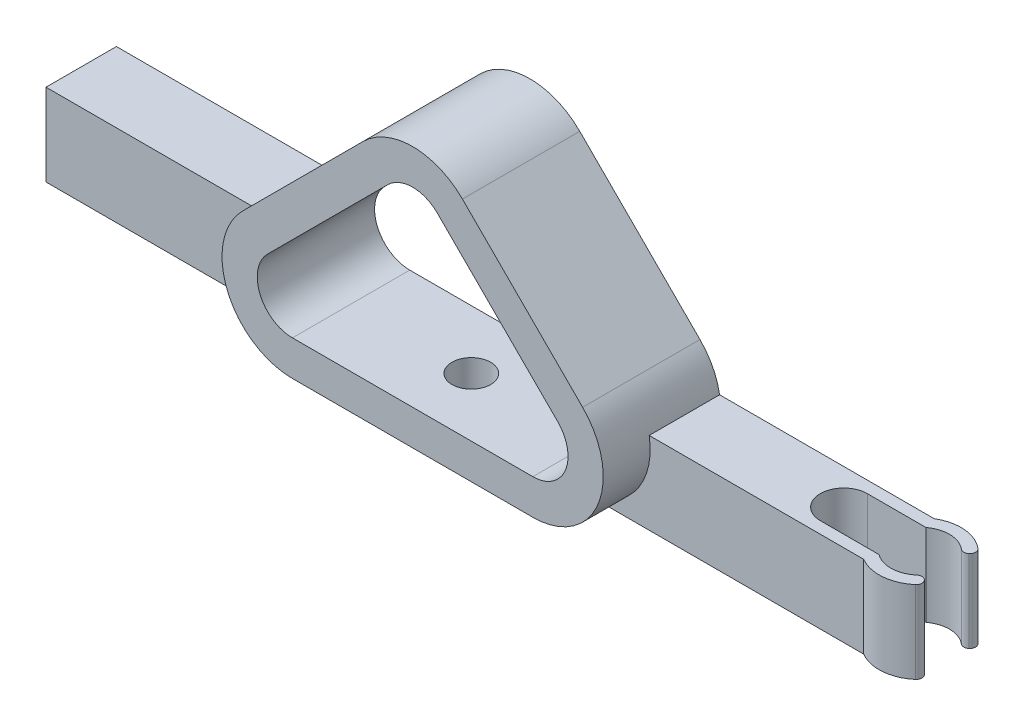
ISO-10303-21;
HEADER;
FILE_DESCRIPTION(('STEP AP214'),'2;1');
FILE_NAME('part.step','',(''),(''),'','','');
FILE_SCHEMA(('AUTOMOTIVE_DESIGN { 1 0 10303 214 1 1 1 1 }'));
ENDSEC;
DATA;
#1=APPLICATION_CONTEXT('core data for automotive mechanical design processes');
#2=APPLICATION_PROTOCOL_DEFINITION('international standard','automotive_design',2000,#1);
#3=PRODUCT_CONTEXT('',#1,'mechanical');
#4=PRODUCT('Part','Part','',(#3));
#5=PRODUCT_RELATED_PRODUCT_CATEGORY('part','',(#4));
#6=PRODUCT_DEFINITION_FORMATION('','',#4);
#7=PRODUCT_DEFINITION_CONTEXT('part definition',#1,'design');
#8=PRODUCT_DEFINITION('design','',#6,#7);
#9=PRODUCT_DEFINITION_SHAPE('','',#8);
#10=(LENGTH_UNIT() NAMED_UNIT(*) SI_UNIT(.MILLI.,.METRE.));
#11=(NAMED_UNIT(*) PLANE_ANGLE_UNIT() SI_UNIT($,.RADIAN.));
#12=(NAMED_UNIT(*) SI_UNIT($,.STERADIAN.) SOLID_ANGLE_UNIT());
#13=UNCERTAINTY_MEASURE_WITH_UNIT(LENGTH_MEASURE(1.E-05),#10,'distance_accuracy_value','');
#14=(GEOMETRIC_REPRESENTATION_CONTEXT(3) GLOBAL_UNCERTAINTY_ASSIGNED_CONTEXT((#13)) GLOBAL_UNIT_ASSIGNED_CONTEXT((#10,
#11,#12)) REPRESENTATION_CONTEXT('',''));
#15=CARTESIAN_POINT('',(0.,0.,0.));
#16=DIRECTION('',(0.,0.,1.));
#17=DIRECTION('',(1.,0.,0.));
#18=AXIS2_PLACEMENT_3D('',#15,#16,#17);
#19=CARTESIAN_POINT('',(36.2426406871193,-5.,3.));
#20=DIRECTION('',(0.,-1.,0.));
#21=DIRECTION('',(0.,0.,-1.));
#22=AXIS2_PLACEMENT_3D('',#19,#20,#21);
#23=CYLINDRICAL_SURFACE('',#22,2.5);
#24=CARTESIAN_POINT('',(36.2426406871193,-12.,3.));
#25=DIRECTION('',(0.,-1.,0.));
#26=DIRECTION('',(0.,0.,-1.));
#27=AXIS2_PLACEMENT_3D('',#24,#25,#26);
#28=CIRCLE('',#27,2.5);
#29=CARTESIAN_POINT('',(37.8631375342883,-12.,4.90367801067184));
#30=VERTEX_POINT('',#29);
#31=CARTESIAN_POINT('',(34.7426406871193,-12.,5.00000000000001));
#32=VERTEX_POINT('',#31);
#33=EDGE_CURVE('E269',#30,#32,#28,.T.);
#34=ORIENTED_EDGE('',*,*,#33,.T.);
#35=DIRECTION('',(0.,-1.,0.));
#36=VECTOR('',#35,1.);
#37=CARTESIAN_POINT('',(34.7426406871193,-5.,5.));
#38=LINE('',#37,#36);
#39=CARTESIAN_POINT('',(34.7426406871193,-5.,5.00000000000001));
#40=VERTEX_POINT('',#39);
#41=EDGE_CURVE('E53',#32,#40,#38,.F.);
#42=ORIENTED_EDGE('',*,*,#41,.T.);
#43=CARTESIAN_POINT('',(36.2426406871193,-5.,3.));
#44=DIRECTION('',(0.,-1.,0.));
#45=DIRECTION('',(0.,0.,-1.));
#46=AXIS2_PLACEMENT_3D('',#43,#44,#45);
#47=CIRCLE('',#46,2.5);
#48=CARTESIAN_POINT('',(37.8631375342883,-5.,4.90367801067184));
#49=VERTEX_POINT('',#48);
#50=EDGE_CURVE('E259',#49,#40,#47,.T.);
#51=ORIENTED_EDGE('',*,*,#50,.F.);
#52=DIRECTION('',(0.,-1.,0.));
#53=VECTOR('',#52,1.);
#54=CARTESIAN_POINT('',(37.8631375342883,-5.,4.90367801067184));
#55=LINE('',#54,#53);
#56=EDGE_CURVE('E423',#49,#30,#55,.T.);
#57=ORIENTED_EDGE('',*,*,#56,.T.);
#58=EDGE_LOOP('',(#34,#42,#51,#57));
#59=FACE_BOUND('',#58,.T.);
#60=ADVANCED_FACE('F45',(#59),#23,.F.);
#61=CARTESIAN_POINT('',(10.2426406871193,-6.,10.));
#62=DIRECTION('',(0.,0.,-1.));
#63=DIRECTION('',(-1.,0.,0.));
#64=AXIS2_PLACEMENT_3D('',#61,#62,#63);
#65=CYLINDRICAL_SURFACE('',#64,6.);
#66=DIRECTION('',(0.,0.,-1.));
#67=VECTOR('',#66,1.);
#68=CARTESIAN_POINT('',(16.1587204702189,-5.00000000000001,6.));
#69=LINE('',#68,#67);
#70=CARTESIAN_POINT('',(16.1587204702189,-5.00000000000001,6.));
#71=VERTEX_POINT('',#70);
#72=CARTESIAN_POINT('',(16.1587204702189,-5.00000000000001,0.));
#73=VERTEX_POINT('',#72);
#74=EDGE_CURVE('E292',#71,#73,#69,.T.);
#75=ORIENTED_EDGE('',*,*,#74,.T.);
#76=CARTESIAN_POINT('',(10.2426406871193,-6.,0.));
#77=DIRECTION('',(0.,0.,1.));
#78=DIRECTION('',(-1.,0.,0.));
#79=AXIS2_PLACEMENT_3D('',#76,#77,#78);
#80=CIRCLE('',#79,6.);
#81=CARTESIAN_POINT('',(14.4852813742386,-1.75735931288071,0.));
#82=VERTEX_POINT('',#81);
#83=EDGE_CURVE('E396',#73,#82,#80,.T.);
#84=ORIENTED_EDGE('',*,*,#83,.T.);
#85=DIRECTION('',(0.,0.,-1.));
#86=VECTOR('',#85,1.);
#87=CARTESIAN_POINT('',(14.4852813742386,-1.75735931288071,10.));
#88=LINE('',#87,#86);
#89=CARTESIAN_POINT('',(14.4852813742386,-1.75735931288071,10.));
#90=VERTEX_POINT('',#89);
#91=EDGE_CURVE('E401',#90,#82,#88,.T.);
#92=ORIENTED_EDGE('',*,*,#91,.F.);
#93=CARTESIAN_POINT('',(10.2426406871193,-6.,10.));
#94=DIRECTION('',(0.,0.,1.));
#95=DIRECTION('',(-1.,0.,0.));
#96=AXIS2_PLACEMENT_3D('',#93,#94,#95);
#97=CIRCLE('',#96,6.);
#98=CARTESIAN_POINT('',(10.2426406871193,-12.,10.));
#99=VERTEX_POINT('',#98);
#100=EDGE_CURVE('E382',#99,#90,#97,.T.);
#101=ORIENTED_EDGE('',*,*,#100,.F.);
#102=DIRECTION('',(0.,0.,-1.));
#103=VECTOR('',#102,1.);
#104=CARTESIAN_POINT('',(10.2426406871193,-12.,10.));
#105=LINE('',#104,#103);
#106=CARTESIAN_POINT('',(10.2426406871193,-12.,6.));
#107=VERTEX_POINT('',#106);
#108=EDGE_CURVE('E404',#99,#107,#105,.T.);
#109=ORIENTED_EDGE('',*,*,#108,.T.);
#110=CARTESIAN_POINT('',(10.2426406871193,-5.99999999999999,6.));
#111=DIRECTION('',(0.,0.,-1.));
#112=DIRECTION('',(1.,0.,0.));
#113=AXIS2_PLACEMENT_3D('',#110,#111,#112);
#114=CIRCLE('',#113,6.00000000000001);
#115=EDGE_CURVE('E284',#71,#107,#114,.T.);
#116=ORIENTED_EDGE('',*,*,#115,.F.);
#117=EDGE_LOOP('',(#75,#84,#92,#101,#109,#116));
#118=FACE_BOUND('',#117,.T.);
#119=ADVANCED_FACE('F477',(#118),#65,.T.);
#120=CARTESIAN_POINT('',(-10.2426406871193,-6.,10.));
#121=DIRECTION('',(0.,0.,-1.));
#122=DIRECTION('',(-1.,0.,0.));
#123=AXIS2_PLACEMENT_3D('',#120,#121,#122);
#124=CYLINDRICAL_SURFACE('',#123,6.);
#125=DIRECTION('',(0.,0.,-1.));
#126=VECTOR('',#125,1.);
#127=CARTESIAN_POINT('',(-16.1587204702189,-5.00000000000001,6.));
#128=LINE('',#127,#126);
#129=CARTESIAN_POINT('',(-16.1587204702189,-5.00000000000001,6.));
#130=VERTEX_POINT('',#129);
#131=CARTESIAN_POINT('',(-16.1587204702189,-5.00000000000001,0.));
#132=VERTEX_POINT('',#131);
#133=EDGE_CURVE('E317',#130,#132,#128,.T.);
#134=ORIENTED_EDGE('',*,*,#133,.F.);
#135=CARTESIAN_POINT('',(-10.2426406871193,-5.99999999999999,6.));
#136=DIRECTION('',(0.,0.,-1.));
#137=DIRECTION('',(-1.,0.,0.));
#138=AXIS2_PLACEMENT_3D('',#135,#136,#137);
#139=CIRCLE('',#138,6.00000000000001);
#140=CARTESIAN_POINT('',(-10.2426406871193,-12.,6.));
#141=VERTEX_POINT('',#140);
#142=EDGE_CURVE('E298',#141,#130,#139,.T.);
#143=ORIENTED_EDGE('',*,*,#142,.F.);
#144=DIRECTION('',(0.,0.,-1.));
#145=VECTOR('',#144,1.);
#146=CARTESIAN_POINT('',(-10.2426406871193,-12.,10.));
#147=LINE('',#146,#145);
#148=CARTESIAN_POINT('',(-10.2426406871193,-12.,10.));
#149=VERTEX_POINT('',#148);
#150=EDGE_CURVE('E406',#149,#141,#147,.T.);
#151=ORIENTED_EDGE('',*,*,#150,.F.);
#152=CARTESIAN_POINT('',(-10.2426406871193,-6.,10.));
#153=DIRECTION('',(0.,0.,1.));
#154=DIRECTION('',(1.,0.,0.));
#155=AXIS2_PLACEMENT_3D('',#152,#153,#154);
#156=CIRCLE('',#155,6.);
#157=CARTESIAN_POINT('',(-14.4852813742386,-1.75735931288072,10.));
#158=VERTEX_POINT('',#157);
#159=EDGE_CURVE('E378',#158,#149,#156,.T.);
#160=ORIENTED_EDGE('',*,*,#159,.F.);
#161=DIRECTION('',(0.,0.,-1.));
#162=VECTOR('',#161,1.);
#163=CARTESIAN_POINT('',(-14.4852813742386,-1.75735931288072,10.));
#164=LINE('',#163,#162);
#165=CARTESIAN_POINT('',(-14.4852813742386,-1.75735931288072,0.));
#166=VERTEX_POINT('',#165);
#167=EDGE_CURVE('E409',#158,#166,#164,.T.);
#168=ORIENTED_EDGE('',*,*,#167,.T.);
#169=CARTESIAN_POINT('',(-10.2426406871193,-6.,0.));
#170=DIRECTION('',(0.,0.,1.));
#171=DIRECTION('',(1.,0.,0.));
#172=AXIS2_PLACEMENT_3D('',#169,#170,#171);
#173=CIRCLE('',#172,6.);
#174=EDGE_CURVE('E391',#166,#132,#173,.T.);
#175=ORIENTED_EDGE('',*,*,#174,.T.);
#176=EDGE_LOOP('',(#134,#143,#151,#160,#168,#175));
#177=FACE_BOUND('',#176,.T.);
#178=ADVANCED_FACE('F489',(#177),#124,.T.);
#179=CARTESIAN_POINT('',(0.,4.24264068711928,10.));
#180=DIRECTION('',(0.,0.,-1.));
#181=DIRECTION('',(-1.,0.,0.));
#182=AXIS2_PLACEMENT_3D('',#179,#180,#181);
#183=PLANE('',#182);
#184=CARTESIAN_POINT('',(0.,4.24264068711928,10.));
#185=DIRECTION('',(0.,0.,1.));
#186=DIRECTION('',(-1.,0.,0.));
#187=AXIS2_PLACEMENT_3D('',#184,#185,#186);
#188=CIRCLE('',#187,6.);
#189=CARTESIAN_POINT('',(4.24264068711927,8.48528137423857,10.));
#190=VERTEX_POINT('',#189);
#191=CARTESIAN_POINT('',(-4.24264068711928,8.48528137423857,10.));
#192=VERTEX_POINT('',#191);
#193=EDGE_CURVE('E372',#190,#192,#188,.T.);
#194=ORIENTED_EDGE('',*,*,#193,.T.);
#195=DIRECTION('',(-0.707106781186549,-0.707106781186546,0.));
#196=VECTOR('',#195,1.);
#197=CARTESIAN_POINT('',(-14.4852813742386,-1.75735931288072,10.));
#198=LINE('',#197,#196);
#199=EDGE_CURVE('E375',#192,#158,#198,.T.);
#200=ORIENTED_EDGE('',*,*,#199,.T.);
#201=ORIENTED_EDGE('',*,*,#159,.T.);
#202=DIRECTION('',(1.,0.,0.));
#203=VECTOR('',#202,1.);
#204=CARTESIAN_POINT('',(10.2426406871193,-12.,10.));
#205=LINE('',#204,#203);
#206=EDGE_CURVE('E380',#149,#99,#205,.T.);
#207=ORIENTED_EDGE('',*,*,#206,.T.);
#208=ORIENTED_EDGE('',*,*,#100,.T.);
#209=DIRECTION('',(-0.707106781186549,0.707106781186546,0.));
#210=VECTOR('',#209,1.);
#211=CARTESIAN_POINT('',(14.4852813742386,-1.75735931288072,10.));
#212=LINE('',#211,#210);
#213=EDGE_CURVE('E384',#90,#190,#212,.T.);
#214=ORIENTED_EDGE('',*,*,#213,.T.);
#215=EDGE_LOOP('',(#194,#200,#201,#207,#208,#214));
#216=FACE_BOUND('',#215,.T.);
#217=CARTESIAN_POINT('',(0.,4.24264068711928,10.));
#218=DIRECTION('',(0.,0.,1.));
#219=DIRECTION('',(-1.,0.,0.));
#220=AXIS2_PLACEMENT_3D('',#217,#218,#219);
#221=CIRCLE('',#220,3.);
#222=CARTESIAN_POINT('',(2.12132034355964,6.36396103067892,10.));
#223=VERTEX_POINT('',#222);
#224=CARTESIAN_POINT('',(-2.12132034355963,6.36396103067892,10.));
#225=VERTEX_POINT('',#224);
#226=EDGE_CURVE('E327',#223,#225,#221,.T.);
#227=ORIENTED_EDGE('',*,*,#226,.F.);
#228=DIRECTION('',(-0.707106781186549,0.707106781186546,0.));
#229=VECTOR('',#228,1.);
#230=CARTESIAN_POINT('',(12.363961030679,-3.87867965644036,10.));
#231=LINE('',#230,#229);
#232=CARTESIAN_POINT('',(12.363961030679,-3.87867965644036,10.));
#233=VERTEX_POINT('',#232);
#234=EDGE_CURVE('E339',#233,#223,#231,.T.);
#235=ORIENTED_EDGE('',*,*,#234,.F.);
#236=CARTESIAN_POINT('',(10.2426406871193,-6.,10.));
#237=DIRECTION('',(0.,0.,1.));
#238=DIRECTION('',(-1.,0.,0.));
#239=AXIS2_PLACEMENT_3D('',#236,#237,#238);
#240=CIRCLE('',#239,3.);
#241=CARTESIAN_POINT('',(10.2426406871193,-9.,10.));
#242=VERTEX_POINT('',#241);
#243=EDGE_CURVE('E336',#242,#233,#240,.T.);
#244=ORIENTED_EDGE('',*,*,#243,.F.);
#245=DIRECTION('',(1.,0.,0.));
#246=VECTOR('',#245,1.);
#247=CARTESIAN_POINT('',(10.2426406871193,-9.,10.));
#248=LINE('',#247,#246);
#249=CARTESIAN_POINT('',(-10.2426406871193,-9.,10.));
#250=VERTEX_POINT('',#249);
#251=EDGE_CURVE('E334',#250,#242,#248,.T.);
#252=ORIENTED_EDGE('',*,*,#251,.F.);
#253=CARTESIAN_POINT('',(-10.2426406871193,-6.,10.));
#254=DIRECTION('',(0.,0.,1.));
#255=DIRECTION('',(-1.,0.,0.));
#256=AXIS2_PLACEMENT_3D('',#253,#254,#255);
#257=CIRCLE('',#256,3.);
#258=CARTESIAN_POINT('',(-12.363961030679,-3.87867965644036,10.));
#259=VERTEX_POINT('',#258);
#260=EDGE_CURVE('E332',#259,#250,#257,.T.);
#261=ORIENTED_EDGE('',*,*,#260,.F.);
#262=DIRECTION('',(-0.707106781186549,-0.707106781186546,0.));
#263=VECTOR('',#262,1.);
#264=CARTESIAN_POINT('',(-12.363961030679,-3.87867965644036,10.));
#265=LINE('',#264,#263);
#266=EDGE_CURVE('E329',#225,#259,#265,.T.);
#267=ORIENTED_EDGE('',*,*,#266,.F.);
#268=EDGE_LOOP('',(#227,#235,#244,#252,#261,#267));
#269=FACE_BOUND('',#268,.T.);
#270=ADVANCED_FACE('F480',(#216,#269),#183,.F.);
#271=CARTESIAN_POINT('',(0.,4.24264068711928,0.));
#272=DIRECTION('',(0.,0.,-1.));
#273=DIRECTION('',(-1.,0.,0.));
#274=AXIS2_PLACEMENT_3D('',#271,#272,#273);
#275=PLANE('',#274);
#276=CARTESIAN_POINT('',(0.,4.24264068711928,0.));
#277=DIRECTION('',(0.,0.,1.));
#278=DIRECTION('',(-1.,0.,0.));
#279=AXIS2_PLACEMENT_3D('',#276,#277,#278);
#280=CIRCLE('',#279,6.);
#281=CARTESIAN_POINT('',(4.24264068711927,8.48528137423857,0.));
#282=VERTEX_POINT('',#281);
#283=CARTESIAN_POINT('',(-4.24264068711928,8.48528137423857,0.));
#284=VERTEX_POINT('',#283);
#285=EDGE_CURVE('E371',#282,#284,#280,.T.);
#286=ORIENTED_EDGE('',*,*,#285,.F.);
#287=DIRECTION('',(-0.707106781186549,0.707106781186546,0.));
#288=VECTOR('',#287,1.);
#289=CARTESIAN_POINT('',(14.4852813742386,-1.75735931288072,0.));
#290=LINE('',#289,#288);
#291=EDGE_CURVE('E376',#82,#282,#290,.T.);
#292=ORIENTED_EDGE('',*,*,#291,.F.);
#293=ORIENTED_EDGE('',*,*,#83,.F.);
#294=DIRECTION('',(-1.,0.,0.));
#295=VECTOR('',#294,1.);
#296=CARTESIAN_POINT('',(30.2426406871193,-5.,0.));
#297=LINE('',#296,#295);
#298=CARTESIAN_POINT('',(34.4398650493873,-5.,0.));
#299=VERTEX_POINT('',#298);
#300=EDGE_CURVE('E281',#299,#73,#297,.T.);
#301=ORIENTED_EDGE('',*,*,#300,.F.);
#302=DIRECTION('',(0.,-1.,0.));
#303=VECTOR('',#302,1.);
#304=CARTESIAN_POINT('',(34.4398650493873,-5.,0.));
#305=LINE('',#304,#303);
#306=CARTESIAN_POINT('',(34.4398650493873,-12.,0.));
#307=VERTEX_POINT('',#306);
#308=EDGE_CURVE('E278',#299,#307,#305,.T.);
#309=ORIENTED_EDGE('',*,*,#308,.T.);
#310=DIRECTION('',(1.,0.,0.));
#311=VECTOR('',#310,1.);
#312=CARTESIAN_POINT('',(10.2426406871193,-12.,0.));
#313=LINE('',#312,#311);
#314=CARTESIAN_POINT('',(-35.2426406871193,-12.,0.));
#315=VERTEX_POINT('',#314);
#316=EDGE_CURVE('E394',#315,#307,#313,.T.);
#317=ORIENTED_EDGE('',*,*,#316,.F.);
#318=DIRECTION('',(0.,-1.,0.));
#319=VECTOR('',#318,1.);
#320=CARTESIAN_POINT('',(-35.2426406871193,-12.,0.));
#321=LINE('',#320,#319);
#322=CARTESIAN_POINT('',(-35.2426406871193,-5.00000000000001,0.));
#323=VERTEX_POINT('',#322);
#324=EDGE_CURVE('E302',#323,#315,#321,.T.);
#325=ORIENTED_EDGE('',*,*,#324,.F.);
#326=DIRECTION('',(-1.,0.,0.));
#327=VECTOR('',#326,1.);
#328=CARTESIAN_POINT('',(-35.2426406871193,-5.00000000000001,0.));
#329=LINE('',#328,#327);
#330=EDGE_CURVE('E297',#132,#323,#329,.T.);
#331=ORIENTED_EDGE('',*,*,#330,.F.);
#332=ORIENTED_EDGE('',*,*,#174,.F.);
#333=DIRECTION('',(-0.707106781186549,-0.707106781186546,0.));
#334=VECTOR('',#333,1.);
#335=CARTESIAN_POINT('',(-14.4852813742386,-1.75735931288072,0.));
#336=LINE('',#335,#334);
#337=EDGE_CURVE('E389',#284,#166,#336,.T.);
#338=ORIENTED_EDGE('',*,*,#337,.F.);
#339=EDGE_LOOP('',(#286,#292,#293,#301,#309,#317,#325,#331,#332,#338));
#340=FACE_BOUND('',#339,.T.);
#341=DIRECTION('',(-0.707106781186549,0.707106781186546,0.));
#342=VECTOR('',#341,1.);
#343=CARTESIAN_POINT('',(12.363961030679,-3.87867965644036,0.));
#344=LINE('',#343,#342);
#345=CARTESIAN_POINT('',(12.363961030679,-3.87867965644036,0.));
#346=VERTEX_POINT('',#345);
#347=CARTESIAN_POINT('',(2.12132034355964,6.36396103067892,0.));
#348=VERTEX_POINT('',#347);
#349=EDGE_CURVE('E330',#346,#348,#344,.T.);
#350=ORIENTED_EDGE('',*,*,#349,.T.);
#351=CARTESIAN_POINT('',(0.,4.24264068711928,0.));
#352=DIRECTION('',(0.,0.,1.));
#353=DIRECTION('',(-1.,0.,0.));
#354=AXIS2_PLACEMENT_3D('',#351,#352,#353);
#355=CIRCLE('',#354,3.);
#356=CARTESIAN_POINT('',(-2.12132034355963,6.36396103067892,0.));
#357=VERTEX_POINT('',#356);
#358=EDGE_CURVE('E326',#348,#357,#355,.T.);
#359=ORIENTED_EDGE('',*,*,#358,.T.);
#360=DIRECTION('',(-0.707106781186549,-0.707106781186546,0.));
#361=VECTOR('',#360,1.);
#362=CARTESIAN_POINT('',(-12.363961030679,-3.87867965644036,0.));
#363=LINE('',#362,#361);
#364=CARTESIAN_POINT('',(-12.363961030679,-3.87867965644036,0.));
#365=VERTEX_POINT('',#364);
#366=EDGE_CURVE('E344',#357,#365,#363,.T.);
#367=ORIENTED_EDGE('',*,*,#366,.T.);
#368=CARTESIAN_POINT('',(-10.2426406871193,-6.,0.));
#369=DIRECTION('',(0.,0.,1.));
#370=DIRECTION('',(-1.,0.,0.));
#371=AXIS2_PLACEMENT_3D('',#368,#369,#370);
#372=CIRCLE('',#371,3.);
#373=CARTESIAN_POINT('',(-10.2426406871193,-9.,0.));
#374=VERTEX_POINT('',#373);
#375=EDGE_CURVE('E347',#365,#374,#372,.T.);
#376=ORIENTED_EDGE('',*,*,#375,.T.);
#377=DIRECTION('',(1.,0.,0.));
#378=VECTOR('',#377,1.);
#379=CARTESIAN_POINT('',(10.2426406871193,-9.,0.));
#380=LINE('',#379,#378);
#381=CARTESIAN_POINT('',(10.2426406871193,-9.,0.));
#382=VERTEX_POINT('',#381);
#383=EDGE_CURVE('E350',#374,#382,#380,.T.);
#384=ORIENTED_EDGE('',*,*,#383,.T.);
#385=CARTESIAN_POINT('',(10.2426406871193,-6.,0.));
#386=DIRECTION('',(0.,0.,1.));
#387=DIRECTION('',(-1.,0.,0.));
#388=AXIS2_PLACEMENT_3D('',#385,#386,#387);
#389=CIRCLE('',#388,3.);
#390=EDGE_CURVE('E353',#382,#346,#389,.T.);
#391=ORIENTED_EDGE('',*,*,#390,.T.);
#392=EDGE_LOOP('',(#350,#359,#367,#376,#384,#391));
#393=FACE_BOUND('',#392,.T.);
#394=ADVANCED_FACE('F501',(#340,#393),#275,.T.);
#395=CARTESIAN_POINT('',(0.,4.24264068711928,10.));
#396=DIRECTION('',(0.,0.,-1.));
#397=DIRECTION('',(-1.,0.,0.));
#398=AXIS2_PLACEMENT_3D('',#395,#396,#397);
#399=CYLINDRICAL_SURFACE('',#398,6.);
#400=ORIENTED_EDGE('',*,*,#285,.T.);
#401=DIRECTION('',(0.,0.,-1.));
#402=VECTOR('',#401,1.);
#403=CARTESIAN_POINT('',(-4.24264068711928,8.48528137423857,10.));
#404=LINE('',#403,#402);
#405=EDGE_CURVE('E412',#192,#284,#404,.T.);
#406=ORIENTED_EDGE('',*,*,#405,.F.);
#407=ORIENTED_EDGE('',*,*,#193,.F.);
#408=DIRECTION('',(0.,0.,-1.));
#409=VECTOR('',#408,1.);
#410=CARTESIAN_POINT('',(4.24264068711927,8.48528137423857,10.));
#411=LINE('',#410,#409);
#412=EDGE_CURVE('E386',#190,#282,#411,.T.);
#413=ORIENTED_EDGE('',*,*,#412,.T.);
#414=EDGE_LOOP('',(#400,#406,#407,#413));
#415=FACE_BOUND('',#414,.T.);
#416=ADVANCED_FACE('F590',(#415),#399,.T.);
#417=CARTESIAN_POINT('',(-14.4852813742386,-1.75735931288072,10.));
#418=DIRECTION('',(0.707106781186546,-0.707106781186549,0.));
#419=DIRECTION('',(0.707106781186549,0.707106781186546,0.));
#420=AXIS2_PLACEMENT_3D('',#417,#418,#419);
#421=PLANE('',#420);
#422=ORIENTED_EDGE('',*,*,#337,.T.);
#423=ORIENTED_EDGE('',*,*,#167,.F.);
#424=ORIENTED_EDGE('',*,*,#199,.F.);
#425=ORIENTED_EDGE('',*,*,#405,.T.);
#426=EDGE_LOOP('',(#422,#423,#424,#425));
#427=FACE_BOUND('',#426,.T.);
#428=ADVANCED_FACE('F596',(#427),#421,.F.);
#429=CARTESIAN_POINT('',(10.2426406871193,-12.,10.));
#430=DIRECTION('',(0.,1.,0.));
#431=DIRECTION('',(0.,0.,1.));
#432=AXIS2_PLACEMENT_3D('',#429,#430,#431);
#433=PLANE('',#432);
#434=CARTESIAN_POINT('',(0.,-12.,5.));
#435=DIRECTION('',(0.,-1.,0.));
#436=DIRECTION('',(0.,0.,-1.));
#437=AXIS2_PLACEMENT_3D('',#434,#435,#436);
#438=CIRCLE('',#437,1.65);
#439=CARTESIAN_POINT('',(0.,-12.,3.35));
#440=VERTEX_POINT('',#439);
#441=EDGE_CURVE('E320',#440,#440,#438,.T.);
#442=ORIENTED_EDGE('',*,*,#441,.F.);
#443=EDGE_LOOP('',(#442));
#444=FACE_BOUND('',#443,.T.);
#445=CARTESIAN_POINT('',(29.7426406871193,-12.,3.));
#446=DIRECTION('',(0.,-1.,0.));
#447=DIRECTION('',(0.,0.,-1.));
#448=AXIS2_PLACEMENT_3D('',#445,#446,#447);
#449=CIRCLE('',#448,2.);
#450=CARTESIAN_POINT('',(29.7426406871193,-12.,5.));
#451=VERTEX_POINT('',#450);
#452=CARTESIAN_POINT('',(29.7426406871193,-12.,1.));
#453=VERTEX_POINT('',#452);
#454=EDGE_CURVE('E239',#451,#453,#449,.T.);
#455=ORIENTED_EDGE('',*,*,#454,.F.);
#456=DIRECTION('',(-1.,0.,0.));
#457=VECTOR('',#456,1.);
#458=CARTESIAN_POINT('',(29.7426406871193,-12.,5.));
#459=LINE('',#458,#457);
#460=EDGE_CURVE('E236',#32,#451,#459,.T.);
#461=ORIENTED_EDGE('',*,*,#460,.F.);
#462=ORIENTED_EDGE('',*,*,#33,.F.);
#463=CARTESIAN_POINT('',(38.1872369037221,-12.,5.28441361280621));
#464=DIRECTION('',(0.,1.,0.));
#465=DIRECTION('',(0.,0.,1.));
#466=AXIS2_PLACEMENT_3D('',#463,#464,#465);
#467=CIRCLE('',#466,0.5);
#468=CARTESIAN_POINT('',(38.5086307085653,-12.,4.90139139124672));
#469=VERTEX_POINT('',#468);
#470=EDGE_CURVE('E415',#30,#469,#467,.F.);
#471=ORIENTED_EDGE('',*,*,#470,.T.);
#472=CARTESIAN_POINT('',(38.1872369037221,-12.,5.28441361280622));
#473=DIRECTION('',(0.,1.,0.));
#474=DIRECTION('',(0.,0.,1.));
#475=AXIS2_PLACEMENT_3D('',#472,#473,#474);
#476=CIRCLE('',#475,0.5);
#477=CARTESIAN_POINT('',(38.5113362731559,-12.,5.66514921494058));
#478=VERTEX_POINT('',#477);
#479=EDGE_CURVE('E417',#469,#478,#476,.F.);
#480=ORIENTED_EDGE('',*,*,#479,.T.);
#481=CARTESIAN_POINT('',(36.2426406871193,-12.,3.));
#482=DIRECTION('',(0.,-1.,0.));
#483=DIRECTION('',(0.,0.,-1.));
#484=AXIS2_PLACEMENT_3D('',#481,#482,#483);
#485=CIRCLE('',#484,3.50000000000001);
#486=CARTESIAN_POINT('',(34.4398650493873,-12.,6.));
#487=VERTEX_POINT('',#486);
#488=EDGE_CURVE('E272',#487,#478,#485,.F.);
#489=ORIENTED_EDGE('',*,*,#488,.F.);
#490=DIRECTION('',(1.,0.,0.));
#491=VECTOR('',#490,1.);
#492=CARTESIAN_POINT('',(10.2426406871193,-12.,6.));
#493=LINE('',#492,#491);
#494=EDGE_CURVE('E287',#107,#487,#493,.T.);
#495=ORIENTED_EDGE('',*,*,#494,.F.);
#496=ORIENTED_EDGE('',*,*,#108,.F.);
#497=ORIENTED_EDGE('',*,*,#206,.F.);
#498=ORIENTED_EDGE('',*,*,#150,.T.);
#499=DIRECTION('',(1.,0.,0.));
#500=VECTOR('',#499,1.);
#501=CARTESIAN_POINT('',(-10.2426406871193,-12.,6.));
#502=LINE('',#501,#500);
#503=CARTESIAN_POINT('',(-35.2426406871193,-12.,6.));
#504=VERTEX_POINT('',#503);
#505=EDGE_CURVE('E306',#504,#141,#502,.T.);
#506=ORIENTED_EDGE('',*,*,#505,.F.);
#507=DIRECTION('',(0.,0.,-1.));
#508=VECTOR('',#507,1.);
#509=CARTESIAN_POINT('',(-35.2426406871193,-12.,6.));
#510=LINE('',#509,#508);
#511=EDGE_CURVE('E308',#504,#315,#510,.T.);
#512=ORIENTED_EDGE('',*,*,#511,.T.);
#513=ORIENTED_EDGE('',*,*,#316,.T.);
#514=CARTESIAN_POINT('',(36.2426406871193,-12.,3.));
#515=DIRECTION('',(0.,-1.,0.));
#516=DIRECTION('',(0.,0.,-1.));
#517=AXIS2_PLACEMENT_3D('',#514,#515,#516);
#518=CIRCLE('',#517,3.50000000000001);
#519=CARTESIAN_POINT('',(38.5113362731559,-12.,0.334850785059418));
#520=VERTEX_POINT('',#519);
#521=EDGE_CURVE('E275',#307,#520,#518,.T.);
#522=ORIENTED_EDGE('',*,*,#521,.T.);
#523=CARTESIAN_POINT('',(38.1872369037221,-12.,0.715586387193788));
#524=DIRECTION('',(0.,1.,0.));
#525=DIRECTION('',(0.,0.,1.));
#526=AXIS2_PLACEMENT_3D('',#523,#524,#525);
#527=CIRCLE('',#526,0.5);
#528=CARTESIAN_POINT('',(38.5086307085653,-12.,1.09860860875327));
#529=VERTEX_POINT('',#528);
#530=EDGE_CURVE('E419',#520,#529,#527,.F.);
#531=ORIENTED_EDGE('',*,*,#530,.T.);
#532=CARTESIAN_POINT('',(38.1872369037221,-12.,0.715586387193793));
#533=DIRECTION('',(0.,1.,0.));
#534=DIRECTION('',(0.,0.,1.));
#535=AXIS2_PLACEMENT_3D('',#532,#533,#534);
#536=CIRCLE('',#535,0.5);
#537=CARTESIAN_POINT('',(37.8631375342883,-12.,1.09632198932816));
#538=VERTEX_POINT('',#537);
#539=EDGE_CURVE('E421',#529,#538,#536,.F.);
#540=ORIENTED_EDGE('',*,*,#539,.T.);
#541=CARTESIAN_POINT('',(34.7426406871193,-12.,1.));
#542=VERTEX_POINT('',#541);
#543=EDGE_CURVE('E249',#542,#538,#28,.T.);
#544=ORIENTED_EDGE('',*,*,#543,.F.);
#545=DIRECTION('',(1.,0.,0.));
#546=VECTOR('',#545,1.);
#547=CARTESIAN_POINT('',(29.7426406871193,-12.,1.));
#548=LINE('',#547,#546);
#549=EDGE_CURVE('E60',#453,#542,#548,.T.);
#550=ORIENTED_EDGE('',*,*,#549,.F.);
#551=EDGE_LOOP('',(#455,#461,#462,#471,#480,#489,#495,#496,#497,#498,#506,#512,#513,#522,#531,
#540,#544,#550));
#552=FACE_BOUND('',#551,.T.);
#553=ADVANCED_FACE('F247',(#444,#552),#433,.F.);
#554=CARTESIAN_POINT('',(14.4852813742386,-1.75735931288072,10.));
#555=DIRECTION('',(-0.707106781186546,-0.707106781186549,0.));
#556=DIRECTION('',(0.707106781186549,-0.707106781186546,0.));
#557=AXIS2_PLACEMENT_3D('',#554,#555,#556);
#558=PLANE('',#557);
#559=ORIENTED_EDGE('',*,*,#291,.T.);
#560=ORIENTED_EDGE('',*,*,#412,.F.);
#561=ORIENTED_EDGE('',*,*,#213,.F.);
#562=ORIENTED_EDGE('',*,*,#91,.T.);
#563=EDGE_LOOP('',(#559,#560,#561,#562));
#564=FACE_BOUND('',#563,.T.);
#565=ADVANCED_FACE('F584',(#564),#558,.F.);
#566=CARTESIAN_POINT('',(0.,4.24264068711928,10.));
#567=DIRECTION('',(0.,0.,-1.));
#568=DIRECTION('',(-1.,0.,0.));
#569=AXIS2_PLACEMENT_3D('',#566,#567,#568);
#570=CYLINDRICAL_SURFACE('',#569,3.);
#571=ORIENTED_EDGE('',*,*,#358,.F.);
#572=DIRECTION('',(0.,0.,-1.));
#573=VECTOR('',#572,1.);
#574=CARTESIAN_POINT('',(2.12132034355964,6.36396103067892,10.));
#575=LINE('',#574,#573);
#576=EDGE_CURVE('E341',#223,#348,#575,.T.);
#577=ORIENTED_EDGE('',*,*,#576,.F.);
#578=ORIENTED_EDGE('',*,*,#226,.T.);
#579=DIRECTION('',(0.,0.,-1.));
#580=VECTOR('',#579,1.);
#581=CARTESIAN_POINT('',(-2.12132034355963,6.36396103067892,10.));
#582=LINE('',#581,#580);
#583=EDGE_CURVE('E368',#225,#357,#582,.T.);
#584=ORIENTED_EDGE('',*,*,#583,.T.);
#585=EDGE_LOOP('',(#571,#577,#578,#584));
#586=FACE_BOUND('',#585,.T.);
#587=ADVANCED_FACE('F580',(#586),#570,.F.);
#588=CARTESIAN_POINT('',(-12.363961030679,-3.87867965644036,10.));
#589=DIRECTION('',(0.707106781186546,-0.707106781186549,0.));
#590=DIRECTION('',(0.707106781186549,0.707106781186546,0.));
#591=AXIS2_PLACEMENT_3D('',#588,#589,#590);
#592=PLANE('',#591);
#593=ORIENTED_EDGE('',*,*,#366,.F.);
#594=ORIENTED_EDGE('',*,*,#583,.F.);
#595=ORIENTED_EDGE('',*,*,#266,.T.);
#596=DIRECTION('',(0.,0.,-1.));
#597=VECTOR('',#596,1.);
#598=CARTESIAN_POINT('',(-12.363961030679,-3.87867965644036,10.));
#599=LINE('',#598,#597);
#600=EDGE_CURVE('E366',#259,#365,#599,.T.);
#601=ORIENTED_EDGE('',*,*,#600,.T.);
#602=EDGE_LOOP('',(#593,#594,#595,#601));
#603=FACE_BOUND('',#602,.T.);
#604=ADVANCED_FACE('F576',(#603),#592,.T.);
#605=CARTESIAN_POINT('',(-10.2426406871193,-6.,10.));
#606=DIRECTION('',(0.,0.,-1.));
#607=DIRECTION('',(-1.,0.,0.));
#608=AXIS2_PLACEMENT_3D('',#605,#606,#607);
#609=CYLINDRICAL_SURFACE('',#608,3.);
#610=ORIENTED_EDGE('',*,*,#375,.F.);
#611=ORIENTED_EDGE('',*,*,#600,.F.);
#612=ORIENTED_EDGE('',*,*,#260,.T.);
#613=DIRECTION('',(0.,0.,-1.));
#614=VECTOR('',#613,1.);
#615=CARTESIAN_POINT('',(-10.2426406871193,-9.,10.));
#616=LINE('',#615,#614);
#617=EDGE_CURVE('E364',#250,#374,#616,.T.);
#618=ORIENTED_EDGE('',*,*,#617,.T.);
#619=EDGE_LOOP('',(#610,#611,#612,#618));
#620=FACE_BOUND('',#619,.T.);
#621=ADVANCED_FACE('F572',(#620),#609,.F.);
#622=CARTESIAN_POINT('',(10.2426406871193,-9.,10.));
#623=DIRECTION('',(0.,1.,0.));
#624=DIRECTION('',(0.,0.,1.));
#625=AXIS2_PLACEMENT_3D('',#622,#623,#624);
#626=PLANE('',#625);
#627=CARTESIAN_POINT('',(0.,-9.,5.));
#628=DIRECTION('',(0.,1.,0.));
#629=DIRECTION('',(0.,0.,1.));
#630=AXIS2_PLACEMENT_3D('',#627,#628,#629);
#631=CIRCLE('',#630,1.65);
#632=CARTESIAN_POINT('',(0.,-9.,6.65));
#633=VERTEX_POINT('',#632);
#634=EDGE_CURVE('E323',#633,#633,#631,.T.);
#635=ORIENTED_EDGE('',*,*,#634,.F.);
#636=EDGE_LOOP('',(#635));
#637=FACE_BOUND('',#636,.T.);
#638=ORIENTED_EDGE('',*,*,#383,.F.);
#639=ORIENTED_EDGE('',*,*,#617,.F.);
#640=ORIENTED_EDGE('',*,*,#251,.T.);
#641=DIRECTION('',(0.,0.,-1.));
#642=VECTOR('',#641,1.);
#643=CARTESIAN_POINT('',(10.2426406871193,-9.,10.));
#644=LINE('',#643,#642);
#645=EDGE_CURVE('E362',#242,#382,#644,.T.);
#646=ORIENTED_EDGE('',*,*,#645,.T.);
#647=EDGE_LOOP('',(#638,#639,#640,#646));
#648=FACE_BOUND('',#647,.T.);
#649=ADVANCED_FACE('F568',(#637,#648),#626,.T.);
#650=CARTESIAN_POINT('',(10.2426406871193,-6.,10.));
#651=DIRECTION('',(0.,0.,-1.));
#652=DIRECTION('',(-1.,0.,0.));
#653=AXIS2_PLACEMENT_3D('',#650,#651,#652);
#654=CYLINDRICAL_SURFACE('',#653,3.);
#655=ORIENTED_EDGE('',*,*,#390,.F.);
#656=ORIENTED_EDGE('',*,*,#645,.F.);
#657=ORIENTED_EDGE('',*,*,#243,.T.);
#658=DIRECTION('',(0.,0.,-1.));
#659=VECTOR('',#658,1.);
#660=CARTESIAN_POINT('',(12.363961030679,-3.87867965644036,10.));
#661=LINE('',#660,#659);
#662=EDGE_CURVE('E360',#233,#346,#661,.T.);
#663=ORIENTED_EDGE('',*,*,#662,.T.);
#664=EDGE_LOOP('',(#655,#656,#657,#663));
#665=FACE_BOUND('',#664,.T.);
#666=ADVANCED_FACE('F564',(#665),#654,.F.);
#667=CARTESIAN_POINT('',(12.363961030679,-3.87867965644036,10.));
#668=DIRECTION('',(-0.707106781186546,-0.707106781186549,0.));
#669=DIRECTION('',(0.707106781186549,-0.707106781186546,0.));
#670=AXIS2_PLACEMENT_3D('',#667,#668,#669);
#671=PLANE('',#670);
#672=ORIENTED_EDGE('',*,*,#349,.F.);
#673=ORIENTED_EDGE('',*,*,#662,.F.);
#674=ORIENTED_EDGE('',*,*,#234,.T.);
#675=ORIENTED_EDGE('',*,*,#576,.T.);
#676=EDGE_LOOP('',(#672,#673,#674,#675));
#677=FACE_BOUND('',#676,.T.);
#678=ADVANCED_FACE('F560',(#677),#671,.T.);
#679=CARTESIAN_POINT('',(0.,-12.,5.));
#680=DIRECTION('',(0.,-1.,0.));
#681=DIRECTION('',(0.,0.,-1.));
#682=AXIS2_PLACEMENT_3D('',#679,#680,#681);
#683=CYLINDRICAL_SURFACE('',#682,1.65);
#684=ORIENTED_EDGE('',*,*,#441,.T.);
#685=EDGE_LOOP('',(#684));
#686=FACE_BOUND('',#685,.T.);
#687=ORIENTED_EDGE('',*,*,#634,.T.);
#688=EDGE_LOOP('',(#687));
#689=FACE_BOUND('',#688,.T.);
#690=ADVANCED_FACE('F556',(#686,#689),#683,.F.);
#691=CARTESIAN_POINT('',(-35.2426406871193,-5.00000000000001,6.));
#692=DIRECTION('',(0.,-1.,0.));
#693=DIRECTION('',(0.,0.,-1.));
#694=AXIS2_PLACEMENT_3D('',#691,#692,#693);
#695=PLANE('',#694);
#696=ORIENTED_EDGE('',*,*,#330,.T.);
#697=DIRECTION('',(0.,0.,-1.));
#698=VECTOR('',#697,1.);
#699=CARTESIAN_POINT('',(-35.2426406871193,-5.00000000000001,6.));
#700=LINE('',#699,#698);
#701=CARTESIAN_POINT('',(-35.2426406871193,-5.00000000000001,6.));
#702=VERTEX_POINT('',#701);
#703=EDGE_CURVE('E314',#702,#323,#700,.T.);
#704=ORIENTED_EDGE('',*,*,#703,.F.);
#705=DIRECTION('',(-1.,0.,0.));
#706=VECTOR('',#705,1.);
#707=CARTESIAN_POINT('',(-35.2426406871193,-5.00000000000001,6.));
#708=LINE('',#707,#706);
#709=EDGE_CURVE('E301',#130,#702,#708,.T.);
#710=ORIENTED_EDGE('',*,*,#709,.F.);
#711=ORIENTED_EDGE('',*,*,#133,.T.);
#712=EDGE_LOOP('',(#696,#704,#710,#711));
#713=FACE_BOUND('',#712,.T.);
#714=ADVANCED_FACE('F553',(#713),#695,.F.);
#715=CARTESIAN_POINT('',(-35.2426406871193,-12.,6.));
#716=DIRECTION('',(1.,0.,0.));
#717=DIRECTION('',(0.,0.,-1.));
#718=AXIS2_PLACEMENT_3D('',#715,#716,#717);
#719=PLANE('',#718);
#720=ORIENTED_EDGE('',*,*,#324,.T.);
#721=ORIENTED_EDGE('',*,*,#511,.F.);
#722=DIRECTION('',(0.,-1.,0.));
#723=VECTOR('',#722,1.);
#724=CARTESIAN_POINT('',(-35.2426406871193,-12.,6.));
#725=LINE('',#724,#723);
#726=EDGE_CURVE('E304',#702,#504,#725,.T.);
#727=ORIENTED_EDGE('',*,*,#726,.F.);
#728=ORIENTED_EDGE('',*,*,#703,.T.);
#729=EDGE_LOOP('',(#720,#721,#727,#728));
#730=FACE_BOUND('',#729,.T.);
#731=ADVANCED_FACE('F497',(#730),#719,.F.);
#732=CARTESIAN_POINT('',(-10.2426406871193,-5.99999999999999,6.));
#733=DIRECTION('',(0.,0.,-1.));
#734=DIRECTION('',(-1.,0.,0.));
#735=AXIS2_PLACEMENT_3D('',#732,#733,#734);
#736=PLANE('',#735);
#737=ORIENTED_EDGE('',*,*,#142,.T.);
#738=ORIENTED_EDGE('',*,*,#709,.T.);
#739=ORIENTED_EDGE('',*,*,#726,.T.);
#740=ORIENTED_EDGE('',*,*,#505,.T.);
#741=EDGE_LOOP('',(#737,#738,#739,#740));
#742=FACE_BOUND('',#741,.T.);
#743=ADVANCED_FACE('F493',(#742),#736,.F.);
#744=CARTESIAN_POINT('',(30.2426406871193,-5.,6.));
#745=DIRECTION('',(0.,-1.,0.));
#746=DIRECTION('',(1.,0.,0.));
#747=AXIS2_PLACEMENT_3D('',#744,#745,#746);
#748=PLANE('',#747);
#749=ORIENTED_EDGE('',*,*,#50,.T.);
#750=DIRECTION('',(-1.,0.,0.));
#751=VECTOR('',#750,1.);
#752=CARTESIAN_POINT('',(30.2426406871193,-5.,5.));
#753=LINE('',#752,#751);
#754=CARTESIAN_POINT('',(29.7426406871193,-5.,5.));
#755=VERTEX_POINT('',#754);
#756=EDGE_CURVE('E255',#40,#755,#753,.T.);
#757=ORIENTED_EDGE('',*,*,#756,.T.);
#758=CARTESIAN_POINT('',(29.7426406871193,-5.,3.));
#759=DIRECTION('',(0.,-1.,0.));
#760=DIRECTION('',(1.,0.,0.));
#761=AXIS2_PLACEMENT_3D('',#758,#759,#760);
#762=CIRCLE('',#761,2.);
#763=CARTESIAN_POINT('',(29.7426406871193,-5.,1.));
#764=VERTEX_POINT('',#763);
#765=EDGE_CURVE('E11',#755,#764,#762,.T.);
#766=ORIENTED_EDGE('',*,*,#765,.T.);
#767=DIRECTION('',(1.,0.,0.));
#768=VECTOR('',#767,1.);
#769=CARTESIAN_POINT('',(30.2426406871193,-5.,1.));
#770=LINE('',#769,#768);
#771=CARTESIAN_POINT('',(34.7426406871193,-5.,1.));
#772=VERTEX_POINT('',#771);
#773=EDGE_CURVE('E233',#764,#772,#770,.T.);
#774=ORIENTED_EDGE('',*,*,#773,.T.);
#775=CARTESIAN_POINT('',(37.8631375342883,-5.,1.09632198932816));
#776=VERTEX_POINT('',#775);
#777=EDGE_CURVE('E263',#772,#776,#47,.T.);
#778=ORIENTED_EDGE('',*,*,#777,.T.);
#779=CARTESIAN_POINT('',(38.1872369037221,-5.,0.715586387193793));
#780=DIRECTION('',(0.,-1.,0.));
#781=DIRECTION('',(1.,0.,0.));
#782=AXIS2_PLACEMENT_3D('',#779,#780,#781);
#783=CIRCLE('',#782,0.5);
#784=CARTESIAN_POINT('',(38.5086307085653,-5.,1.09860860875327));
#785=VERTEX_POINT('',#784);
#786=EDGE_CURVE('E434',#776,#785,#783,.F.);
#787=ORIENTED_EDGE('',*,*,#786,.T.);
#788=CARTESIAN_POINT('',(38.1872369037221,-5.,0.715586387193788));
#789=DIRECTION('',(0.,-1.,0.));
#790=DIRECTION('',(1.,0.,0.));
#791=AXIS2_PLACEMENT_3D('',#788,#789,#790);
#792=CIRCLE('',#791,0.5);
#793=CARTESIAN_POINT('',(38.5113362731559,-5.,0.334850785059418));
#794=VERTEX_POINT('',#793);
#795=EDGE_CURVE('E68',#785,#794,#792,.F.);
#796=ORIENTED_EDGE('',*,*,#795,.T.);
#797=CARTESIAN_POINT('',(36.2426406871193,-5.,3.));
#798=DIRECTION('',(0.,-1.,0.));
#799=DIRECTION('',(0.,0.,-1.));
#800=AXIS2_PLACEMENT_3D('',#797,#798,#799);
#801=CIRCLE('',#800,3.50000000000001);
#802=EDGE_CURVE('E266',#299,#794,#801,.T.);
#803=ORIENTED_EDGE('',*,*,#802,.F.);
#804=ORIENTED_EDGE('',*,*,#300,.T.);
#805=ORIENTED_EDGE('',*,*,#74,.F.);
#806=DIRECTION('',(-1.,0.,0.));
#807=VECTOR('',#806,1.);
#808=CARTESIAN_POINT('',(30.2426406871193,-5.,6.));
#809=LINE('',#808,#807);
#810=CARTESIAN_POINT('',(34.4398650493873,-5.,6.));
#811=VERTEX_POINT('',#810);
#812=EDGE_CURVE('E289',#811,#71,#809,.T.);
#813=ORIENTED_EDGE('',*,*,#812,.F.);
#814=CARTESIAN_POINT('',(36.2426406871193,-5.,3.));
#815=DIRECTION('',(0.,-1.,0.));
#816=DIRECTION('',(0.,0.,-1.));
#817=AXIS2_PLACEMENT_3D('',#814,#815,#816);
#818=CIRCLE('',#817,3.50000000000001);
#819=CARTESIAN_POINT('',(38.5113362731559,-5.,5.66514921494058));
#820=VERTEX_POINT('',#819);
#821=EDGE_CURVE('E262',#811,#820,#818,.F.);
#822=ORIENTED_EDGE('',*,*,#821,.T.);
#823=CARTESIAN_POINT('',(38.1872369037221,-5.,5.28441361280622));
#824=DIRECTION('',(0.,-1.,0.));
#825=DIRECTION('',(1.,0.,0.));
#826=AXIS2_PLACEMENT_3D('',#823,#824,#825);
#827=CIRCLE('',#826,0.5);
#828=CARTESIAN_POINT('',(38.5086307085653,-5.,4.90139139124672));
#829=VERTEX_POINT('',#828);
#830=EDGE_CURVE('E431',#820,#829,#827,.F.);
#831=ORIENTED_EDGE('',*,*,#830,.T.);
#832=CARTESIAN_POINT('',(38.1872369037221,-5.,5.28441361280621));
#833=DIRECTION('',(0.,-1.,0.));
#834=DIRECTION('',(1.,0.,0.));
#835=AXIS2_PLACEMENT_3D('',#832,#833,#834);
#836=CIRCLE('',#835,0.5);
#837=EDGE_CURVE('E429',#829,#49,#836,.F.);
#838=ORIENTED_EDGE('',*,*,#837,.T.);
#839=EDGE_LOOP('',(#749,#757,#766,#774,#778,#787,#796,#803,#804,#805,#813,#822,#831,#838));
#840=FACE_BOUND('',#839,.T.);
#841=ADVANCED_FACE('F454',(#840),#748,.F.);
#842=CARTESIAN_POINT('',(10.2426406871193,-5.99999999999999,6.));
#843=DIRECTION('',(0.,0.,1.));
#844=DIRECTION('',(1.,0.,0.));
#845=AXIS2_PLACEMENT_3D('',#842,#843,#844);
#846=PLANE('',#845);
#847=ORIENTED_EDGE('',*,*,#115,.T.);
#848=ORIENTED_EDGE('',*,*,#494,.T.);
#849=DIRECTION('',(0.,-1.,0.));
#850=VECTOR('',#849,1.);
#851=CARTESIAN_POINT('',(34.4398650493873,-5.,6.));
#852=LINE('',#851,#850);
#853=EDGE_CURVE('E268',#811,#487,#852,.T.);
#854=ORIENTED_EDGE('',*,*,#853,.F.);
#855=ORIENTED_EDGE('',*,*,#812,.T.);
#856=EDGE_LOOP('',(#847,#848,#854,#855));
#857=FACE_BOUND('',#856,.T.);
#858=ADVANCED_FACE('F470',(#857),#846,.T.);
#859=ORIENTED_EDGE('',*,*,#777,.F.);
#860=DIRECTION('',(0.,-1.,0.));
#861=VECTOR('',#860,1.);
#862=CARTESIAN_POINT('',(34.7426406871193,-5.,1.));
#863=LINE('',#862,#861);
#864=EDGE_CURVE('E441',#772,#542,#863,.T.);
#865=ORIENTED_EDGE('',*,*,#864,.T.);
#866=ORIENTED_EDGE('',*,*,#543,.T.);
#867=DIRECTION('',(0.,-1.,0.));
#868=VECTOR('',#867,1.);
#869=CARTESIAN_POINT('',(37.8631375342883,-5.,1.09632198932816));
#870=LINE('',#869,#868);
#871=EDGE_CURVE('E425',#538,#776,#870,.F.);
#872=ORIENTED_EDGE('',*,*,#871,.T.);
#873=EDGE_LOOP('',(#859,#865,#866,#872));
#874=FACE_BOUND('',#873,.T.);
#875=ADVANCED_FACE('F519',(#874),#23,.F.);
#876=CARTESIAN_POINT('',(36.2426406871193,-5.,3.));
#877=DIRECTION('',(0.,-1.,0.));
#878=DIRECTION('',(0.,0.,-1.));
#879=AXIS2_PLACEMENT_3D('',#876,#877,#878);
#880=CYLINDRICAL_SURFACE('',#879,3.50000000000001);
#881=ORIENTED_EDGE('',*,*,#802,.T.);
#882=DIRECTION('',(0.,-1.,0.));
#883=VECTOR('',#882,1.);
#884=CARTESIAN_POINT('',(38.5113362731559,-5.,0.334850785059418));
#885=LINE('',#884,#883);
#886=EDGE_CURVE('E436',#794,#520,#885,.T.);
#887=ORIENTED_EDGE('',*,*,#886,.T.);
#888=ORIENTED_EDGE('',*,*,#521,.F.);
#889=ORIENTED_EDGE('',*,*,#308,.F.);
#890=EDGE_LOOP('',(#881,#887,#888,#889));
#891=FACE_BOUND('',#890,.T.);
#892=ADVANCED_FACE('F538',(#891),#880,.T.);
#893=CARTESIAN_POINT('',(36.2426406871193,-5.,3.));
#894=DIRECTION('',(0.,-1.,0.));
#895=DIRECTION('',(0.,0.,-1.));
#896=AXIS2_PLACEMENT_3D('',#893,#894,#895);
#897=CYLINDRICAL_SURFACE('',#896,3.50000000000001);
#898=ORIENTED_EDGE('',*,*,#488,.T.);
#899=DIRECTION('',(0.,-1.,0.));
#900=VECTOR('',#899,1.);
#901=CARTESIAN_POINT('',(38.5113362731559,-5.,5.66514921494058));
#902=LINE('',#901,#900);
#903=EDGE_CURVE('E438',#478,#820,#902,.F.);
#904=ORIENTED_EDGE('',*,*,#903,.T.);
#905=ORIENTED_EDGE('',*,*,#821,.F.);
#906=ORIENTED_EDGE('',*,*,#853,.T.);
#907=EDGE_LOOP('',(#898,#904,#905,#906));
#908=FACE_BOUND('',#907,.T.);
#909=ADVANCED_FACE('F466',(#908),#897,.T.);
#910=CARTESIAN_POINT('',(38.1872369037221,-5.,0.715586387193788));
#911=DIRECTION('',(0.,-1.,0.));
#912=DIRECTION('',(0.,0.,-1.));
#913=AXIS2_PLACEMENT_3D('',#910,#911,#912);
#914=CYLINDRICAL_SURFACE('',#913,0.5);
#915=ORIENTED_EDGE('',*,*,#886,.F.);
#916=ORIENTED_EDGE('',*,*,#795,.F.);
#917=DIRECTION('',(0.,-1.,0.));
#918=VECTOR('',#917,1.);
#919=CARTESIAN_POINT('',(38.5086307085653,-5.,1.09860860875327));
#920=LINE('',#919,#918);
#921=EDGE_CURVE('E442',#529,#785,#920,.F.);
#922=ORIENTED_EDGE('',*,*,#921,.F.);
#923=ORIENTED_EDGE('',*,*,#530,.F.);
#924=EDGE_LOOP('',(#915,#916,#922,#923));
#925=FACE_BOUND('',#924,.T.);
#926=ADVANCED_FACE('F511',(#925),#914,.T.);
#927=CARTESIAN_POINT('',(38.1872369037221,-5.,0.715586387193793));
#928=DIRECTION('',(0.,-1.,0.));
#929=DIRECTION('',(0.,0.,-1.));
#930=AXIS2_PLACEMENT_3D('',#927,#928,#929);
#931=CYLINDRICAL_SURFACE('',#930,0.5);
#932=ORIENTED_EDGE('',*,*,#786,.F.);
#933=ORIENTED_EDGE('',*,*,#871,.F.);
#934=ORIENTED_EDGE('',*,*,#539,.F.);
#935=ORIENTED_EDGE('',*,*,#921,.T.);
#936=EDGE_LOOP('',(#932,#933,#934,#935));
#937=FACE_BOUND('',#936,.T.);
#938=ADVANCED_FACE('F516',(#937),#931,.T.);
#939=CARTESIAN_POINT('',(38.1872369037221,-5.,5.28441361280621));
#940=DIRECTION('',(0.,-1.,0.));
#941=DIRECTION('',(0.,0.,-1.));
#942=AXIS2_PLACEMENT_3D('',#939,#940,#941);
#943=CYLINDRICAL_SURFACE('',#942,0.5);
#944=ORIENTED_EDGE('',*,*,#56,.F.);
#945=ORIENTED_EDGE('',*,*,#837,.F.);
#946=DIRECTION('',(0.,-1.,0.));
#947=VECTOR('',#946,1.);
#948=CARTESIAN_POINT('',(38.5086307085653,-5.,4.90139139124672));
#949=LINE('',#948,#947);
#950=EDGE_CURVE('E258',#469,#829,#949,.F.);
#951=ORIENTED_EDGE('',*,*,#950,.F.);
#952=ORIENTED_EDGE('',*,*,#470,.F.);
#953=EDGE_LOOP('',(#944,#945,#951,#952));
#954=FACE_BOUND('',#953,.T.);
#955=ADVANCED_FACE('F47',(#954),#943,.T.);
#956=CARTESIAN_POINT('',(38.1872369037221,-5.,5.28441361280622));
#957=DIRECTION('',(0.,-1.,0.));
#958=DIRECTION('',(0.,0.,-1.));
#959=AXIS2_PLACEMENT_3D('',#956,#957,#958);
#960=CYLINDRICAL_SURFACE('',#959,0.5);
#961=ORIENTED_EDGE('',*,*,#830,.F.);
#962=ORIENTED_EDGE('',*,*,#903,.F.);
#963=ORIENTED_EDGE('',*,*,#479,.F.);
#964=ORIENTED_EDGE('',*,*,#950,.T.);
#965=EDGE_LOOP('',(#961,#962,#963,#964));
#966=FACE_BOUND('',#965,.T.);
#967=ADVANCED_FACE('F461',(#966),#960,.T.);
#968=CARTESIAN_POINT('',(29.7426406871193,10.2426406871193,3.));
#969=DIRECTION('',(0.,-1.,0.));
#970=DIRECTION('',(0.,0.,-1.));
#971=AXIS2_PLACEMENT_3D('',#968,#969,#970);
#972=CYLINDRICAL_SURFACE('',#971,2.);
#973=DIRECTION('',(0.,-1.,0.));
#974=VECTOR('',#973,1.);
#975=CARTESIAN_POINT('',(29.7426406871193,10.2426406871193,5.));
#976=LINE('',#975,#974);
#977=EDGE_CURVE('E235',#755,#451,#976,.T.);
#978=ORIENTED_EDGE('',*,*,#977,.T.);
#979=ORIENTED_EDGE('',*,*,#454,.T.);
#980=DIRECTION('',(0.,-1.,0.));
#981=VECTOR('',#980,1.);
#982=CARTESIAN_POINT('',(29.7426406871193,10.2426406871193,1.));
#983=LINE('',#982,#981);
#984=EDGE_CURVE('E229',#764,#453,#983,.T.);
#985=ORIENTED_EDGE('',*,*,#984,.F.);
#986=ORIENTED_EDGE('',*,*,#765,.F.);
#987=EDGE_LOOP('',(#978,#979,#985,#986));
#988=FACE_BOUND('',#987,.T.);
#989=ADVANCED_FACE('F240',(#988),#972,.F.);
#990=CARTESIAN_POINT('',(29.7426406871193,10.2426406871193,5.));
#991=DIRECTION('',(0.,0.,1.));
#992=DIRECTION('',(1.,0.,0.));
#993=AXIS2_PLACEMENT_3D('',#990,#991,#992);
#994=PLANE('',#993);
#995=ORIENTED_EDGE('',*,*,#41,.F.);
#996=ORIENTED_EDGE('',*,*,#460,.T.);
#997=ORIENTED_EDGE('',*,*,#977,.F.);
#998=ORIENTED_EDGE('',*,*,#756,.F.);
#999=EDGE_LOOP('',(#995,#996,#997,#998));
#1000=FACE_BOUND('',#999,.T.);
#1001=ADVANCED_FACE('F520',(#1000),#994,.F.);
#1002=CARTESIAN_POINT('',(29.7426406871193,10.2426406871193,1.));
#1003=DIRECTION('',(0.,0.,-1.));
#1004=DIRECTION('',(-1.,0.,0.));
#1005=AXIS2_PLACEMENT_3D('',#1002,#1003,#1004);
#1006=PLANE('',#1005);
#1007=ORIENTED_EDGE('',*,*,#984,.T.);
#1008=ORIENTED_EDGE('',*,*,#549,.T.);
#1009=ORIENTED_EDGE('',*,*,#864,.F.);
#1010=ORIENTED_EDGE('',*,*,#773,.F.);
#1011=EDGE_LOOP('',(#1007,#1008,#1009,#1010));
#1012=FACE_BOUND('',#1011,.T.);
#1013=ADVANCED_FACE('F231',(#1012),#1006,.F.);
#1014=CLOSED_SHELL('',(#60,#119,#178,#270,#394,#416,#428,#553,#565,#587,#604,#621,#649,#666,
#678,#690,#714,#731,#743,#841,#858,#875,#892,#909,#926,#938,#955,#967,#989,#1001,#1013));
#1015=MANIFOLD_SOLID_BREP('B2',#1014);
#1016=ADVANCED_BREP_SHAPE_REPRESENTATION('',(#18,#1015),#14);
#1017=SHAPE_DEFINITION_REPRESENTATION(#9,#1016);
ENDSEC;
END-ISO-10303-21;
